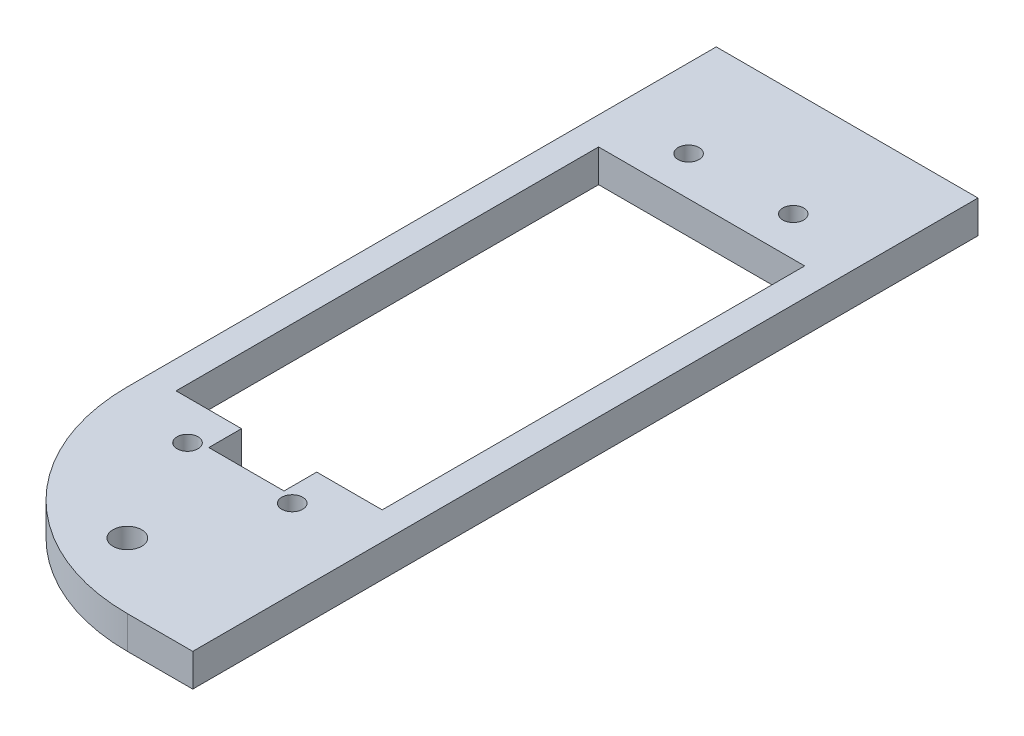
ISO-10303-21;
HEADER;
FILE_DESCRIPTION(('STEP AP214'),'2;1');
FILE_NAME('part.step','',(''),(''),'','','');
FILE_SCHEMA(('AUTOMOTIVE_DESIGN { 1 0 10303 214 1 1 1 1 }'));
ENDSEC;
DATA;
#1=APPLICATION_CONTEXT('core data for automotive mechanical design processes');
#2=APPLICATION_PROTOCOL_DEFINITION('international standard','automotive_design',2000,#1);
#3=PRODUCT_CONTEXT('',#1,'mechanical');
#4=PRODUCT('Part','Part','',(#3));
#5=PRODUCT_RELATED_PRODUCT_CATEGORY('part','',(#4));
#6=PRODUCT_DEFINITION_FORMATION('','',#4);
#7=PRODUCT_DEFINITION_CONTEXT('part definition',#1,'design');
#8=PRODUCT_DEFINITION('design','',#6,#7);
#9=PRODUCT_DEFINITION_SHAPE('','',#8);
#10=(LENGTH_UNIT() NAMED_UNIT(*) SI_UNIT(.MILLI.,.METRE.));
#11=(NAMED_UNIT(*) PLANE_ANGLE_UNIT() SI_UNIT($,.RADIAN.));
#12=(NAMED_UNIT(*) SI_UNIT($,.STERADIAN.) SOLID_ANGLE_UNIT());
#13=UNCERTAINTY_MEASURE_WITH_UNIT(LENGTH_MEASURE(1.E-05),#10,'distance_accuracy_value','');
#14=(GEOMETRIC_REPRESENTATION_CONTEXT(3) GLOBAL_UNCERTAINTY_ASSIGNED_CONTEXT((#13)) GLOBAL_UNIT_ASSIGNED_CONTEXT((#10,
#11,#12)) REPRESENTATION_CONTEXT('',''));
#15=CARTESIAN_POINT('',(0.,0.,0.));
#16=DIRECTION('',(0.,0.,1.));
#17=DIRECTION('',(1.,0.,0.));
#18=AXIS2_PLACEMENT_3D('',#15,#16,#17);
#19=CARTESIAN_POINT('',(12.7,0.,-38.1));
#20=DIRECTION('',(1.,0.,0.));
#21=DIRECTION('',(0.,0.,-1.));
#22=AXIS2_PLACEMENT_3D('',#19,#20,#21);
#23=PLANE('',#22);
#24=DIRECTION('',(0.,0.,1.));
#25=VECTOR('',#24,1.);
#26=CARTESIAN_POINT('',(12.7,-3.175,-38.1));
#27=LINE('',#26,#25);
#28=CARTESIAN_POINT('',(12.7,-3.175,-38.1));
#29=VERTEX_POINT('',#28);
#30=CARTESIAN_POINT('',(12.7,-3.175,38.1));
#31=VERTEX_POINT('',#30);
#32=EDGE_CURVE('E224',#29,#31,#27,.T.);
#33=ORIENTED_EDGE('',*,*,#32,.F.);
#34=DIRECTION('',(0.,-1.,0.));
#35=VECTOR('',#34,1.);
#36=CARTESIAN_POINT('',(12.7,0.,-38.1));
#37=LINE('',#36,#35);
#38=CARTESIAN_POINT('',(12.7,0.,-38.1));
#39=VERTEX_POINT('',#38);
#40=EDGE_CURVE('E11',#39,#29,#37,.T.);
#41=ORIENTED_EDGE('',*,*,#40,.F.);
#42=DIRECTION('',(0.,0.,1.));
#43=VECTOR('',#42,1.);
#44=CARTESIAN_POINT('',(12.7,0.,-38.1));
#45=LINE('',#44,#43);
#46=CARTESIAN_POINT('',(12.7,0.,38.1));
#47=VERTEX_POINT('',#46);
#48=EDGE_CURVE('E227',#39,#47,#45,.T.);
#49=ORIENTED_EDGE('',*,*,#48,.T.);
#50=DIRECTION('',(0.,-1.,0.));
#51=VECTOR('',#50,1.);
#52=CARTESIAN_POINT('',(12.7,0.,38.1));
#53=LINE('',#52,#51);
#54=EDGE_CURVE('E38',#47,#31,#53,.T.);
#55=ORIENTED_EDGE('',*,*,#54,.T.);
#56=EDGE_LOOP('',(#33,#41,#49,#55));
#57=FACE_BOUND('',#56,.T.);
#58=ADVANCED_FACE('F35',(#57),#23,.T.);
#59=CARTESIAN_POINT('',(-12.7,0.,-38.1));
#60=DIRECTION('',(0.,0.,-1.));
#61=DIRECTION('',(-1.,0.,0.));
#62=AXIS2_PLACEMENT_3D('',#59,#60,#61);
#63=PLANE('',#62);
#64=DIRECTION('',(1.,0.,0.));
#65=VECTOR('',#64,1.);
#66=CARTESIAN_POINT('',(-12.7,-3.175,-38.1));
#67=LINE('',#66,#65);
#68=CARTESIAN_POINT('',(-12.7,-3.175,-38.1));
#69=VERTEX_POINT('',#68);
#70=EDGE_CURVE('E231',#69,#29,#67,.T.);
#71=ORIENTED_EDGE('',*,*,#70,.F.);
#72=DIRECTION('',(0.,-1.,0.));
#73=VECTOR('',#72,1.);
#74=CARTESIAN_POINT('',(-12.7,0.,-38.1));
#75=LINE('',#74,#73);
#76=CARTESIAN_POINT('',(-12.7,0.,-38.1));
#77=VERTEX_POINT('',#76);
#78=EDGE_CURVE('E43',#77,#69,#75,.T.);
#79=ORIENTED_EDGE('',*,*,#78,.F.);
#80=DIRECTION('',(1.,0.,0.));
#81=VECTOR('',#80,1.);
#82=CARTESIAN_POINT('',(-12.7,0.,-38.1));
#83=LINE('',#82,#81);
#84=EDGE_CURVE('E240',#77,#39,#83,.T.);
#85=ORIENTED_EDGE('',*,*,#84,.T.);
#86=ORIENTED_EDGE('',*,*,#40,.T.);
#87=EDGE_LOOP('',(#71,#79,#85,#86));
#88=FACE_BOUND('',#87,.T.);
#89=ADVANCED_FACE('F272',(#88),#63,.T.);
#90=CARTESIAN_POINT('',(-12.7,0.,19.05));
#91=DIRECTION('',(-1.,0.,0.));
#92=DIRECTION('',(0.,0.,1.));
#93=AXIS2_PLACEMENT_3D('',#90,#91,#92);
#94=PLANE('',#93);
#95=DIRECTION('',(0.,0.,-1.));
#96=VECTOR('',#95,1.);
#97=CARTESIAN_POINT('',(-12.7,-3.175,19.05));
#98=LINE('',#97,#96);
#99=CARTESIAN_POINT('',(-12.7,-3.175,19.05));
#100=VERTEX_POINT('',#99);
#101=EDGE_CURVE('E251',#100,#69,#98,.T.);
#102=ORIENTED_EDGE('',*,*,#101,.F.);
#103=DIRECTION('',(0.,-1.,0.));
#104=VECTOR('',#103,1.);
#105=CARTESIAN_POINT('',(-12.7,0.,19.05));
#106=LINE('',#105,#104);
#107=CARTESIAN_POINT('',(-12.7,0.,19.05));
#108=VERTEX_POINT('',#107);
#109=EDGE_CURVE('E257',#108,#100,#106,.T.);
#110=ORIENTED_EDGE('',*,*,#109,.F.);
#111=DIRECTION('',(0.,0.,-1.));
#112=VECTOR('',#111,1.);
#113=CARTESIAN_POINT('',(-12.7,0.,19.05));
#114=LINE('',#113,#112);
#115=EDGE_CURVE('E237',#108,#77,#114,.T.);
#116=ORIENTED_EDGE('',*,*,#115,.T.);
#117=ORIENTED_EDGE('',*,*,#78,.T.);
#118=EDGE_LOOP('',(#102,#110,#116,#117));
#119=FACE_BOUND('',#118,.T.);
#120=ADVANCED_FACE('F280',(#119),#94,.T.);
#121=CARTESIAN_POINT('',(6.35,0.,19.05));
#122=DIRECTION('',(0.,-1.,0.));
#123=DIRECTION('',(0.,0.,-1.));
#124=AXIS2_PLACEMENT_3D('',#121,#122,#123);
#125=CYLINDRICAL_SURFACE('',#124,19.05);
#126=CARTESIAN_POINT('',(6.35,-3.175,19.05));
#127=DIRECTION('',(0.,-1.,0.));
#128=DIRECTION('',(0.,0.,-1.));
#129=AXIS2_PLACEMENT_3D('',#126,#127,#128);
#130=CIRCLE('',#129,19.05);
#131=CARTESIAN_POINT('',(6.35,-3.175,38.1));
#132=VERTEX_POINT('',#131);
#133=EDGE_CURVE('E248',#132,#100,#130,.T.);
#134=ORIENTED_EDGE('',*,*,#133,.F.);
#135=DIRECTION('',(0.,-1.,0.));
#136=VECTOR('',#135,1.);
#137=CARTESIAN_POINT('',(6.35,0.,38.1));
#138=LINE('',#137,#136);
#139=CARTESIAN_POINT('',(6.35,0.,38.1));
#140=VERTEX_POINT('',#139);
#141=EDGE_CURVE('E258',#140,#132,#138,.T.);
#142=ORIENTED_EDGE('',*,*,#141,.F.);
#143=CARTESIAN_POINT('',(6.35,0.,19.05));
#144=DIRECTION('',(0.,-1.,0.));
#145=DIRECTION('',(0.,0.,-1.));
#146=AXIS2_PLACEMENT_3D('',#143,#144,#145);
#147=CIRCLE('',#146,19.05);
#148=EDGE_CURVE('E234',#140,#108,#147,.T.);
#149=ORIENTED_EDGE('',*,*,#148,.T.);
#150=ORIENTED_EDGE('',*,*,#109,.T.);
#151=EDGE_LOOP('',(#134,#142,#149,#150));
#152=FACE_BOUND('',#151,.T.);
#153=ADVANCED_FACE('F278',(#152),#125,.T.);
#154=CARTESIAN_POINT('',(12.7,0.,38.1));
#155=DIRECTION('',(0.,0.,1.));
#156=DIRECTION('',(1.,0.,0.));
#157=AXIS2_PLACEMENT_3D('',#154,#155,#156);
#158=PLANE('',#157);
#159=DIRECTION('',(-1.,0.,0.));
#160=VECTOR('',#159,1.);
#161=CARTESIAN_POINT('',(12.7,-3.175,38.1));
#162=LINE('',#161,#160);
#163=EDGE_CURVE('E245',#31,#132,#162,.T.);
#164=ORIENTED_EDGE('',*,*,#163,.F.);
#165=ORIENTED_EDGE('',*,*,#54,.F.);
#166=DIRECTION('',(-1.,0.,0.));
#167=VECTOR('',#166,1.);
#168=CARTESIAN_POINT('',(12.7,0.,38.1));
#169=LINE('',#168,#167);
#170=EDGE_CURVE('E230',#47,#140,#169,.T.);
#171=ORIENTED_EDGE('',*,*,#170,.T.);
#172=ORIENTED_EDGE('',*,*,#141,.T.);
#173=EDGE_LOOP('',(#164,#165,#171,#172));
#174=FACE_BOUND('',#173,.T.);
#175=ADVANCED_FACE('F266',(#174),#158,.T.);
#176=CARTESIAN_POINT('',(6.35,0.,19.05));
#177=DIRECTION('',(0.,-1.,0.));
#178=DIRECTION('',(0.,0.,-1.));
#179=AXIS2_PLACEMENT_3D('',#176,#177,#178);
#180=PLANE('',#179);
#181=CARTESIAN_POINT('',(0.,0.,31.75));
#182=DIRECTION('',(0.,-1.,0.));
#183=DIRECTION('',(0.,0.,1.));
#184=AXIS2_PLACEMENT_3D('',#181,#182,#183);
#185=CIRCLE('',#184,1.397);
#186=CARTESIAN_POINT('',(0.,0.,33.147));
#187=VERTEX_POINT('',#186);
#188=EDGE_CURVE('E173',#187,#187,#185,.T.);
#189=ORIENTED_EDGE('',*,*,#188,.T.);
#190=EDGE_LOOP('',(#189));
#191=FACE_BOUND('',#190,.T.);
#192=DIRECTION('',(-1.,0.,0.));
#193=VECTOR('',#192,1.);
#194=CARTESIAN_POINT('',(3.65,0.,17.018));
#195=LINE('',#194,#193);
#196=CARTESIAN_POINT('',(10.,0.,17.018));
#197=VERTEX_POINT('',#196);
#198=CARTESIAN_POINT('',(3.65,0.,17.018));
#199=VERTEX_POINT('',#198);
#200=EDGE_CURVE('E138',#197,#199,#195,.T.);
#201=ORIENTED_EDGE('',*,*,#200,.T.);
#202=DIRECTION('',(0.,0.,1.));
#203=VECTOR('',#202,1.);
#204=CARTESIAN_POINT('',(3.65,0.,20.193));
#205=LINE('',#204,#203);
#206=CARTESIAN_POINT('',(3.65,0.,20.193));
#207=VERTEX_POINT('',#206);
#208=EDGE_CURVE('E132',#199,#207,#205,.T.);
#209=ORIENTED_EDGE('',*,*,#208,.T.);
#210=DIRECTION('',(-1.,0.,0.));
#211=VECTOR('',#210,1.);
#212=CARTESIAN_POINT('',(-3.65,0.,20.193));
#213=LINE('',#212,#211);
#214=CARTESIAN_POINT('',(-3.65,0.,20.193));
#215=VERTEX_POINT('',#214);
#216=EDGE_CURVE('E141',#207,#215,#213,.T.);
#217=ORIENTED_EDGE('',*,*,#216,.T.);
#218=DIRECTION('',(0.,0.,-1.));
#219=VECTOR('',#218,1.);
#220=CARTESIAN_POINT('',(-3.65,0.,17.018));
#221=LINE('',#220,#219);
#222=CARTESIAN_POINT('',(-3.65,0.,17.018));
#223=VERTEX_POINT('',#222);
#224=EDGE_CURVE('E51',#215,#223,#221,.T.);
#225=ORIENTED_EDGE('',*,*,#224,.T.);
#226=DIRECTION('',(-1.,0.,0.));
#227=VECTOR('',#226,1.);
#228=CARTESIAN_POINT('',(-10.,0.,17.018));
#229=LINE('',#228,#227);
#230=CARTESIAN_POINT('',(-10.,0.,17.018));
#231=VERTEX_POINT('',#230);
#232=EDGE_CURVE('E159',#223,#231,#229,.T.);
#233=ORIENTED_EDGE('',*,*,#232,.T.);
#234=DIRECTION('',(0.,0.,-1.));
#235=VECTOR('',#234,1.);
#236=CARTESIAN_POINT('',(-10.,0.,-23.982));
#237=LINE('',#236,#235);
#238=CARTESIAN_POINT('',(-10.,0.,-23.982));
#239=VERTEX_POINT('',#238);
#240=EDGE_CURVE('E162',#231,#239,#237,.T.);
#241=ORIENTED_EDGE('',*,*,#240,.T.);
#242=DIRECTION('',(1.,0.,0.));
#243=VECTOR('',#242,1.);
#244=CARTESIAN_POINT('',(10.,0.,-23.982));
#245=LINE('',#244,#243);
#246=CARTESIAN_POINT('',(10.,0.,-23.982));
#247=VERTEX_POINT('',#246);
#248=EDGE_CURVE('E165',#239,#247,#245,.T.);
#249=ORIENTED_EDGE('',*,*,#248,.T.);
#250=DIRECTION('',(0.,0.,1.));
#251=VECTOR('',#250,1.);
#252=CARTESIAN_POINT('',(10.,0.,17.018));
#253=LINE('',#252,#251);
#254=EDGE_CURVE('E168',#247,#197,#253,.T.);
#255=ORIENTED_EDGE('',*,*,#254,.T.);
#256=EDGE_LOOP('',(#201,#209,#217,#225,#233,#241,#249,#255));
#257=FACE_BOUND('',#256,.T.);
#258=CARTESIAN_POINT('',(5.08,0.,-27.792));
#259=DIRECTION('',(0.,-1.,0.));
#260=DIRECTION('',(0.,0.,1.));
#261=AXIS2_PLACEMENT_3D('',#258,#259,#260);
#262=CIRCLE('',#261,1.016);
#263=CARTESIAN_POINT('',(5.08,0.,-26.776));
#264=VERTEX_POINT('',#263);
#265=EDGE_CURVE('E203',#264,#264,#262,.T.);
#266=ORIENTED_EDGE('',*,*,#265,.T.);
#267=EDGE_LOOP('',(#266));
#268=FACE_BOUND('',#267,.T.);
#269=CARTESIAN_POINT('',(-5.08,0.,-27.792));
#270=DIRECTION('',(0.,-1.,0.));
#271=DIRECTION('',(0.,0.,1.));
#272=AXIS2_PLACEMENT_3D('',#269,#270,#271);
#273=CIRCLE('',#272,1.016);
#274=CARTESIAN_POINT('',(-5.08,0.,-26.776));
#275=VERTEX_POINT('',#274);
#276=EDGE_CURVE('E209',#275,#275,#273,.T.);
#277=ORIENTED_EDGE('',*,*,#276,.T.);
#278=EDGE_LOOP('',(#277));
#279=FACE_BOUND('',#278,.T.);
#280=CARTESIAN_POINT('',(-5.08,0.,20.828));
#281=DIRECTION('',(0.,-1.,0.));
#282=DIRECTION('',(0.,0.,1.));
#283=AXIS2_PLACEMENT_3D('',#280,#281,#282);
#284=CIRCLE('',#283,1.016);
#285=CARTESIAN_POINT('',(-5.08,0.,21.844));
#286=VERTEX_POINT('',#285);
#287=EDGE_CURVE('E215',#286,#286,#284,.T.);
#288=ORIENTED_EDGE('',*,*,#287,.T.);
#289=EDGE_LOOP('',(#288));
#290=FACE_BOUND('',#289,.T.);
#291=CARTESIAN_POINT('',(5.08,0.,20.828));
#292=DIRECTION('',(0.,-1.,0.));
#293=DIRECTION('',(0.,0.,1.));
#294=AXIS2_PLACEMENT_3D('',#291,#292,#293);
#295=CIRCLE('',#294,1.016);
#296=CARTESIAN_POINT('',(5.08,0.,21.844));
#297=VERTEX_POINT('',#296);
#298=EDGE_CURVE('E221',#297,#297,#295,.T.);
#299=ORIENTED_EDGE('',*,*,#298,.T.);
#300=EDGE_LOOP('',(#299));
#301=FACE_BOUND('',#300,.T.);
#302=ORIENTED_EDGE('',*,*,#48,.F.);
#303=ORIENTED_EDGE('',*,*,#84,.F.);
#304=ORIENTED_EDGE('',*,*,#115,.F.);
#305=ORIENTED_EDGE('',*,*,#148,.F.);
#306=ORIENTED_EDGE('',*,*,#170,.F.);
#307=EDGE_LOOP('',(#302,#303,#304,#305,#306));
#308=FACE_BOUND('',#307,.T.);
#309=ADVANCED_FACE('F145',(#191,#257,#268,#279,#290,#301,#308),#180,.F.);
#310=CARTESIAN_POINT('',(6.35,-3.175,19.05));
#311=DIRECTION('',(0.,-1.,0.));
#312=DIRECTION('',(0.,0.,-1.));
#313=AXIS2_PLACEMENT_3D('',#310,#311,#312);
#314=PLANE('',#313);
#315=CARTESIAN_POINT('',(0.,-3.175,31.75));
#316=DIRECTION('',(0.,-1.,0.));
#317=DIRECTION('',(0.,0.,1.));
#318=AXIS2_PLACEMENT_3D('',#315,#316,#317);
#319=CIRCLE('',#318,1.397);
#320=CARTESIAN_POINT('',(0.,-3.175,33.147));
#321=VERTEX_POINT('',#320);
#322=EDGE_CURVE('E155',#321,#321,#319,.T.);
#323=ORIENTED_EDGE('',*,*,#322,.F.);
#324=EDGE_LOOP('',(#323));
#325=FACE_BOUND('',#324,.T.);
#326=DIRECTION('',(0.,0.,1.));
#327=VECTOR('',#326,1.);
#328=CARTESIAN_POINT('',(3.65,-3.175,20.193));
#329=LINE('',#328,#327);
#330=CARTESIAN_POINT('',(3.65,-3.175,17.018));
#331=VERTEX_POINT('',#330);
#332=CARTESIAN_POINT('',(3.65,-3.175,20.193));
#333=VERTEX_POINT('',#332);
#334=EDGE_CURVE('E59',#331,#333,#329,.T.);
#335=ORIENTED_EDGE('',*,*,#334,.F.);
#336=DIRECTION('',(-1.,0.,0.));
#337=VECTOR('',#336,1.);
#338=CARTESIAN_POINT('',(3.65,-3.175,17.018));
#339=LINE('',#338,#337);
#340=CARTESIAN_POINT('',(10.,-3.175,17.018));
#341=VERTEX_POINT('',#340);
#342=EDGE_CURVE('E149',#341,#331,#339,.T.);
#343=ORIENTED_EDGE('',*,*,#342,.F.);
#344=DIRECTION('',(0.,0.,1.));
#345=VECTOR('',#344,1.);
#346=CARTESIAN_POINT('',(10.,-3.175,17.018));
#347=LINE('',#346,#345);
#348=CARTESIAN_POINT('',(10.,-3.175,-23.982));
#349=VERTEX_POINT('',#348);
#350=EDGE_CURVE('E152',#349,#341,#347,.T.);
#351=ORIENTED_EDGE('',*,*,#350,.F.);
#352=DIRECTION('',(1.,0.,0.));
#353=VECTOR('',#352,1.);
#354=CARTESIAN_POINT('',(10.,-3.175,-23.982));
#355=LINE('',#354,#353);
#356=CARTESIAN_POINT('',(-10.,-3.175,-23.982));
#357=VERTEX_POINT('',#356);
#358=EDGE_CURVE('E184',#357,#349,#355,.T.);
#359=ORIENTED_EDGE('',*,*,#358,.F.);
#360=DIRECTION('',(0.,0.,-1.));
#361=VECTOR('',#360,1.);
#362=CARTESIAN_POINT('',(-10.,-3.175,-23.982));
#363=LINE('',#362,#361);
#364=CARTESIAN_POINT('',(-10.,-3.175,17.018));
#365=VERTEX_POINT('',#364);
#366=EDGE_CURVE('E181',#365,#357,#363,.T.);
#367=ORIENTED_EDGE('',*,*,#366,.F.);
#368=DIRECTION('',(-1.,0.,0.));
#369=VECTOR('',#368,1.);
#370=CARTESIAN_POINT('',(-10.,-3.175,17.018));
#371=LINE('',#370,#369);
#372=CARTESIAN_POINT('',(-3.65,-3.175,17.018));
#373=VERTEX_POINT('',#372);
#374=EDGE_CURVE('E178',#373,#365,#371,.T.);
#375=ORIENTED_EDGE('',*,*,#374,.F.);
#376=DIRECTION('',(0.,0.,-1.));
#377=VECTOR('',#376,1.);
#378=CARTESIAN_POINT('',(-3.65,-3.175,17.018));
#379=LINE('',#378,#377);
#380=CARTESIAN_POINT('',(-3.65,-3.175,20.193));
#381=VERTEX_POINT('',#380);
#382=EDGE_CURVE('E175',#381,#373,#379,.T.);
#383=ORIENTED_EDGE('',*,*,#382,.F.);
#384=DIRECTION('',(-1.,0.,0.));
#385=VECTOR('',#384,1.);
#386=CARTESIAN_POINT('',(-3.65,-3.175,20.193));
#387=LINE('',#386,#385);
#388=EDGE_CURVE('E172',#333,#381,#387,.T.);
#389=ORIENTED_EDGE('',*,*,#388,.F.);
#390=EDGE_LOOP('',(#335,#343,#351,#359,#367,#375,#383,#389));
#391=FACE_BOUND('',#390,.T.);
#392=CARTESIAN_POINT('',(5.08,-3.175,-27.792));
#393=DIRECTION('',(0.,-1.,0.));
#394=DIRECTION('',(0.,0.,1.));
#395=AXIS2_PLACEMENT_3D('',#392,#393,#394);
#396=CIRCLE('',#395,1.016);
#397=CARTESIAN_POINT('',(5.08,-3.175,-26.776));
#398=VERTEX_POINT('',#397);
#399=EDGE_CURVE('E191',#398,#398,#396,.T.);
#400=ORIENTED_EDGE('',*,*,#399,.F.);
#401=EDGE_LOOP('',(#400));
#402=FACE_BOUND('',#401,.T.);
#403=CARTESIAN_POINT('',(-5.08,-3.175,-27.792));
#404=DIRECTION('',(0.,-1.,0.));
#405=DIRECTION('',(0.,0.,1.));
#406=AXIS2_PLACEMENT_3D('',#403,#404,#405);
#407=CIRCLE('',#406,1.016);
#408=CARTESIAN_POINT('',(-5.08,-3.175,-26.776));
#409=VERTEX_POINT('',#408);
#410=EDGE_CURVE('E206',#409,#409,#407,.T.);
#411=ORIENTED_EDGE('',*,*,#410,.F.);
#412=EDGE_LOOP('',(#411));
#413=FACE_BOUND('',#412,.T.);
#414=CARTESIAN_POINT('',(-5.08,-3.175,20.828));
#415=DIRECTION('',(0.,-1.,0.));
#416=DIRECTION('',(0.,0.,1.));
#417=AXIS2_PLACEMENT_3D('',#414,#415,#416);
#418=CIRCLE('',#417,1.016);
#419=CARTESIAN_POINT('',(-5.08,-3.175,21.844));
#420=VERTEX_POINT('',#419);
#421=EDGE_CURVE('E212',#420,#420,#418,.T.);
#422=ORIENTED_EDGE('',*,*,#421,.F.);
#423=EDGE_LOOP('',(#422));
#424=FACE_BOUND('',#423,.T.);
#425=CARTESIAN_POINT('',(5.08,-3.175,20.828));
#426=DIRECTION('',(0.,-1.,0.));
#427=DIRECTION('',(0.,0.,1.));
#428=AXIS2_PLACEMENT_3D('',#425,#426,#427);
#429=CIRCLE('',#428,1.016);
#430=CARTESIAN_POINT('',(5.08,-3.175,21.844));
#431=VERTEX_POINT('',#430);
#432=EDGE_CURVE('E218',#431,#431,#429,.T.);
#433=ORIENTED_EDGE('',*,*,#432,.F.);
#434=EDGE_LOOP('',(#433));
#435=FACE_BOUND('',#434,.T.);
#436=ORIENTED_EDGE('',*,*,#32,.T.);
#437=ORIENTED_EDGE('',*,*,#163,.T.);
#438=ORIENTED_EDGE('',*,*,#133,.T.);
#439=ORIENTED_EDGE('',*,*,#101,.T.);
#440=ORIENTED_EDGE('',*,*,#70,.T.);
#441=EDGE_LOOP('',(#436,#437,#438,#439,#440));
#442=FACE_BOUND('',#441,.T.);
#443=ADVANCED_FACE('F268',(#325,#391,#402,#413,#424,#435,#442),#314,.T.);
#444=CARTESIAN_POINT('',(5.08,0.,20.828));
#445=DIRECTION('',(0.,-1.,0.));
#446=DIRECTION('',(0.,0.,-1.));
#447=AXIS2_PLACEMENT_3D('',#444,#445,#446);
#448=CYLINDRICAL_SURFACE('',#447,1.016);
#449=ORIENTED_EDGE('',*,*,#298,.F.);
#450=EDGE_LOOP('',(#449));
#451=FACE_BOUND('',#450,.T.);
#452=ORIENTED_EDGE('',*,*,#432,.T.);
#453=EDGE_LOOP('',(#452));
#454=FACE_BOUND('',#453,.T.);
#455=ADVANCED_FACE('F331',(#451,#454),#448,.F.);
#456=CARTESIAN_POINT('',(-5.08,0.,20.828));
#457=DIRECTION('',(0.,-1.,0.));
#458=DIRECTION('',(0.,0.,-1.));
#459=AXIS2_PLACEMENT_3D('',#456,#457,#458);
#460=CYLINDRICAL_SURFACE('',#459,1.016);
#461=ORIENTED_EDGE('',*,*,#287,.F.);
#462=EDGE_LOOP('',(#461));
#463=FACE_BOUND('',#462,.T.);
#464=ORIENTED_EDGE('',*,*,#421,.T.);
#465=EDGE_LOOP('',(#464));
#466=FACE_BOUND('',#465,.T.);
#467=ADVANCED_FACE('F341',(#463,#466),#460,.F.);
#468=CARTESIAN_POINT('',(-5.08,0.,-27.792));
#469=DIRECTION('',(0.,-1.,0.));
#470=DIRECTION('',(0.,0.,-1.));
#471=AXIS2_PLACEMENT_3D('',#468,#469,#470);
#472=CYLINDRICAL_SURFACE('',#471,1.016);
#473=ORIENTED_EDGE('',*,*,#276,.F.);
#474=EDGE_LOOP('',(#473));
#475=FACE_BOUND('',#474,.T.);
#476=ORIENTED_EDGE('',*,*,#410,.T.);
#477=EDGE_LOOP('',(#476));
#478=FACE_BOUND('',#477,.T.);
#479=ADVANCED_FACE('F351',(#475,#478),#472,.F.);
#480=CARTESIAN_POINT('',(5.08,0.,-27.792));
#481=DIRECTION('',(0.,-1.,0.));
#482=DIRECTION('',(0.,0.,-1.));
#483=AXIS2_PLACEMENT_3D('',#480,#481,#482);
#484=CYLINDRICAL_SURFACE('',#483,1.016);
#485=ORIENTED_EDGE('',*,*,#265,.F.);
#486=EDGE_LOOP('',(#485));
#487=FACE_BOUND('',#486,.T.);
#488=ORIENTED_EDGE('',*,*,#399,.T.);
#489=EDGE_LOOP('',(#488));
#490=FACE_BOUND('',#489,.T.);
#491=ADVANCED_FACE('F361',(#487,#490),#484,.F.);
#492=CARTESIAN_POINT('',(3.65,0.,20.193));
#493=DIRECTION('',(1.,0.,0.));
#494=DIRECTION('',(0.,0.,-1.));
#495=AXIS2_PLACEMENT_3D('',#492,#493,#494);
#496=PLANE('',#495);
#497=ORIENTED_EDGE('',*,*,#334,.T.);
#498=DIRECTION('',(0.,-1.,0.));
#499=VECTOR('',#498,1.);
#500=CARTESIAN_POINT('',(3.65,0.,20.193));
#501=LINE('',#500,#499);
#502=EDGE_CURVE('E128',#207,#333,#501,.T.);
#503=ORIENTED_EDGE('',*,*,#502,.F.);
#504=ORIENTED_EDGE('',*,*,#208,.F.);
#505=DIRECTION('',(0.,-1.,0.));
#506=VECTOR('',#505,1.);
#507=CARTESIAN_POINT('',(3.65,0.,17.018));
#508=LINE('',#507,#506);
#509=EDGE_CURVE('E189',#199,#331,#508,.T.);
#510=ORIENTED_EDGE('',*,*,#509,.T.);
#511=EDGE_LOOP('',(#497,#503,#504,#510));
#512=FACE_BOUND('',#511,.T.);
#513=ADVANCED_FACE('F130',(#512),#496,.F.);
#514=CARTESIAN_POINT('',(3.65,0.,17.018));
#515=DIRECTION('',(0.,0.,1.));
#516=DIRECTION('',(1.,0.,0.));
#517=AXIS2_PLACEMENT_3D('',#514,#515,#516);
#518=PLANE('',#517);
#519=ORIENTED_EDGE('',*,*,#342,.T.);
#520=ORIENTED_EDGE('',*,*,#509,.F.);
#521=ORIENTED_EDGE('',*,*,#200,.F.);
#522=DIRECTION('',(0.,-1.,0.));
#523=VECTOR('',#522,1.);
#524=CARTESIAN_POINT('',(10.,0.,17.018));
#525=LINE('',#524,#523);
#526=EDGE_CURVE('E192',#197,#341,#525,.T.);
#527=ORIENTED_EDGE('',*,*,#526,.T.);
#528=EDGE_LOOP('',(#519,#520,#521,#527));
#529=FACE_BOUND('',#528,.T.);
#530=ADVANCED_FACE('F380',(#529),#518,.F.);
#531=CARTESIAN_POINT('',(10.,0.,17.018));
#532=DIRECTION('',(1.,0.,0.));
#533=DIRECTION('',(0.,0.,-1.));
#534=AXIS2_PLACEMENT_3D('',#531,#532,#533);
#535=PLANE('',#534);
#536=ORIENTED_EDGE('',*,*,#350,.T.);
#537=ORIENTED_EDGE('',*,*,#526,.F.);
#538=ORIENTED_EDGE('',*,*,#254,.F.);
#539=DIRECTION('',(0.,-1.,0.));
#540=VECTOR('',#539,1.);
#541=CARTESIAN_POINT('',(10.,0.,-23.982));
#542=LINE('',#541,#540);
#543=EDGE_CURVE('E194',#247,#349,#542,.T.);
#544=ORIENTED_EDGE('',*,*,#543,.T.);
#545=EDGE_LOOP('',(#536,#537,#538,#544));
#546=FACE_BOUND('',#545,.T.);
#547=ADVANCED_FACE('F389',(#546),#535,.F.);
#548=CARTESIAN_POINT('',(10.,0.,-23.982));
#549=DIRECTION('',(0.,0.,-1.));
#550=DIRECTION('',(-1.,0.,0.));
#551=AXIS2_PLACEMENT_3D('',#548,#549,#550);
#552=PLANE('',#551);
#553=ORIENTED_EDGE('',*,*,#358,.T.);
#554=ORIENTED_EDGE('',*,*,#543,.F.);
#555=ORIENTED_EDGE('',*,*,#248,.F.);
#556=DIRECTION('',(0.,-1.,0.));
#557=VECTOR('',#556,1.);
#558=CARTESIAN_POINT('',(-10.,0.,-23.982));
#559=LINE('',#558,#557);
#560=EDGE_CURVE('E196',#239,#357,#559,.T.);
#561=ORIENTED_EDGE('',*,*,#560,.T.);
#562=EDGE_LOOP('',(#553,#554,#555,#561));
#563=FACE_BOUND('',#562,.T.);
#564=ADVANCED_FACE('F399',(#563),#552,.F.);
#565=CARTESIAN_POINT('',(-10.,0.,-23.982));
#566=DIRECTION('',(-1.,0.,0.));
#567=DIRECTION('',(0.,0.,1.));
#568=AXIS2_PLACEMENT_3D('',#565,#566,#567);
#569=PLANE('',#568);
#570=ORIENTED_EDGE('',*,*,#366,.T.);
#571=ORIENTED_EDGE('',*,*,#560,.F.);
#572=ORIENTED_EDGE('',*,*,#240,.F.);
#573=DIRECTION('',(0.,-1.,0.));
#574=VECTOR('',#573,1.);
#575=CARTESIAN_POINT('',(-10.,0.,17.018));
#576=LINE('',#575,#574);
#577=EDGE_CURVE('E198',#231,#365,#576,.T.);
#578=ORIENTED_EDGE('',*,*,#577,.T.);
#579=EDGE_LOOP('',(#570,#571,#572,#578));
#580=FACE_BOUND('',#579,.T.);
#581=ADVANCED_FACE('F409',(#580),#569,.F.);
#582=CARTESIAN_POINT('',(-10.,0.,17.018));
#583=DIRECTION('',(0.,0.,1.));
#584=DIRECTION('',(1.,0.,0.));
#585=AXIS2_PLACEMENT_3D('',#582,#583,#584);
#586=PLANE('',#585);
#587=ORIENTED_EDGE('',*,*,#374,.T.);
#588=ORIENTED_EDGE('',*,*,#577,.F.);
#589=ORIENTED_EDGE('',*,*,#232,.F.);
#590=DIRECTION('',(0.,-1.,0.));
#591=VECTOR('',#590,1.);
#592=CARTESIAN_POINT('',(-3.65,0.,17.018));
#593=LINE('',#592,#591);
#594=EDGE_CURVE('E200',#223,#373,#593,.T.);
#595=ORIENTED_EDGE('',*,*,#594,.T.);
#596=EDGE_LOOP('',(#587,#588,#589,#595));
#597=FACE_BOUND('',#596,.T.);
#598=ADVANCED_FACE('F419',(#597),#586,.F.);
#599=CARTESIAN_POINT('',(-3.65,0.,17.018));
#600=DIRECTION('',(-1.,0.,0.));
#601=DIRECTION('',(0.,0.,1.));
#602=AXIS2_PLACEMENT_3D('',#599,#600,#601);
#603=PLANE('',#602);
#604=ORIENTED_EDGE('',*,*,#382,.T.);
#605=ORIENTED_EDGE('',*,*,#594,.F.);
#606=ORIENTED_EDGE('',*,*,#224,.F.);
#607=DIRECTION('',(0.,-1.,0.));
#608=VECTOR('',#607,1.);
#609=CARTESIAN_POINT('',(-3.65,0.,20.193));
#610=LINE('',#609,#608);
#611=EDGE_CURVE('E137',#215,#381,#610,.T.);
#612=ORIENTED_EDGE('',*,*,#611,.T.);
#613=EDGE_LOOP('',(#604,#605,#606,#612));
#614=FACE_BOUND('',#613,.T.);
#615=ADVANCED_FACE('F429',(#614),#603,.F.);
#616=CARTESIAN_POINT('',(-3.65,0.,20.193));
#617=DIRECTION('',(0.,0.,1.));
#618=DIRECTION('',(1.,0.,0.));
#619=AXIS2_PLACEMENT_3D('',#616,#617,#618);
#620=PLANE('',#619);
#621=ORIENTED_EDGE('',*,*,#388,.T.);
#622=ORIENTED_EDGE('',*,*,#611,.F.);
#623=ORIENTED_EDGE('',*,*,#216,.F.);
#624=ORIENTED_EDGE('',*,*,#502,.T.);
#625=EDGE_LOOP('',(#621,#622,#623,#624));
#626=FACE_BOUND('',#625,.T.);
#627=ADVANCED_FACE('F142',(#626),#620,.F.);
#628=CARTESIAN_POINT('',(0.,0.,31.75));
#629=DIRECTION('',(0.,-1.,0.));
#630=DIRECTION('',(0.,0.,-1.));
#631=AXIS2_PLACEMENT_3D('',#628,#629,#630);
#632=CYLINDRICAL_SURFACE('',#631,1.397);
#633=ORIENTED_EDGE('',*,*,#188,.F.);
#634=EDGE_LOOP('',(#633));
#635=FACE_BOUND('',#634,.T.);
#636=ORIENTED_EDGE('',*,*,#322,.T.);
#637=EDGE_LOOP('',(#636));
#638=FACE_BOUND('',#637,.T.);
#639=ADVANCED_FACE('F447',(#635,#638),#632,.F.);
#640=CLOSED_SHELL('',(#58,#89,#120,#153,#175,#309,#443,#455,#467,#479,#491,#513,#530,#547,#564,
#581,#598,#615,#627,#639));
#641=MANIFOLD_SOLID_BREP('B2',#640);
#642=ADVANCED_BREP_SHAPE_REPRESENTATION('',(#18,#641),#14);
#643=SHAPE_DEFINITION_REPRESENTATION(#9,#642);
ENDSEC;
END-ISO-10303-21;
